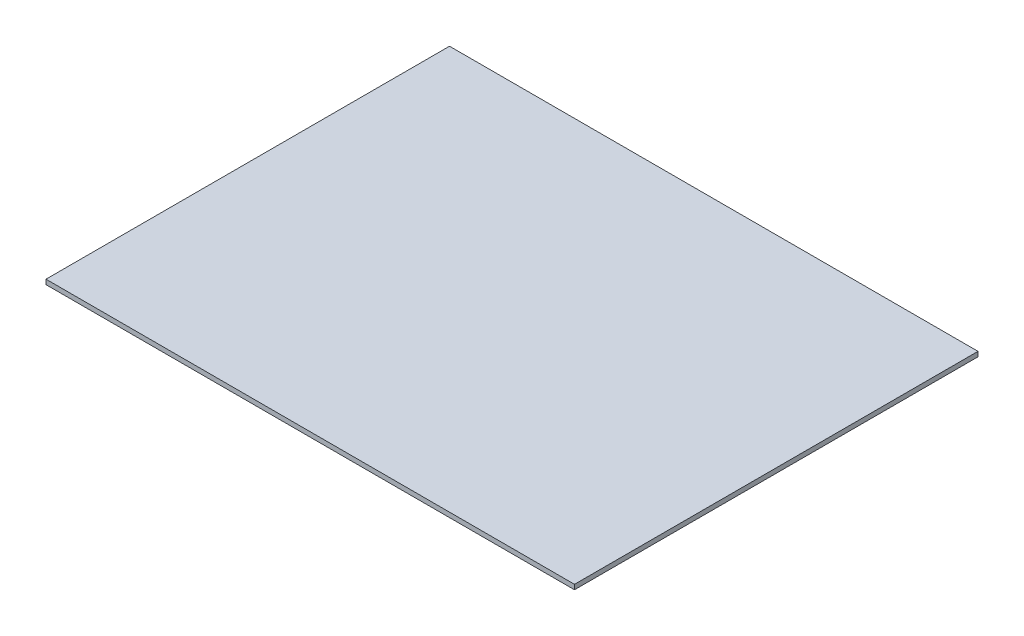
ISO-10303-21;
HEADER;
FILE_DESCRIPTION(('STEP AP214'),'2;1');
FILE_NAME('part.step','',(''),(''),'','','');
FILE_SCHEMA(('AUTOMOTIVE_DESIGN { 1 0 10303 214 1 1 1 1 }'));
ENDSEC;
DATA;
#1=APPLICATION_CONTEXT('core data for automotive mechanical design processes');
#2=APPLICATION_PROTOCOL_DEFINITION('international standard','automotive_design',2000,#1);
#3=PRODUCT_CONTEXT('',#1,'mechanical');
#4=PRODUCT('Part','Part','',(#3));
#5=PRODUCT_RELATED_PRODUCT_CATEGORY('part','',(#4));
#6=PRODUCT_DEFINITION_FORMATION('','',#4);
#7=PRODUCT_DEFINITION_CONTEXT('part definition',#1,'design');
#8=PRODUCT_DEFINITION('design','',#6,#7);
#9=PRODUCT_DEFINITION_SHAPE('','',#8);
#10=(LENGTH_UNIT() NAMED_UNIT(*) SI_UNIT(.MILLI.,.METRE.));
#11=(NAMED_UNIT(*) PLANE_ANGLE_UNIT() SI_UNIT($,.RADIAN.));
#12=(NAMED_UNIT(*) SI_UNIT($,.STERADIAN.) SOLID_ANGLE_UNIT());
#13=UNCERTAINTY_MEASURE_WITH_UNIT(LENGTH_MEASURE(1.E-05),#10,'distance_accuracy_value','');
#14=(GEOMETRIC_REPRESENTATION_CONTEXT(3) GLOBAL_UNCERTAINTY_ASSIGNED_CONTEXT((#13)) GLOBAL_UNIT_ASSIGNED_CONTEXT((#10,
#11,#12)) REPRESENTATION_CONTEXT('',''));
#15=CARTESIAN_POINT('',(0.,0.,0.));
#16=DIRECTION('',(0.,0.,1.));
#17=DIRECTION('',(1.,0.,0.));
#18=AXIS2_PLACEMENT_3D('',#15,#16,#17);
#19=CARTESIAN_POINT('',(222.,4.,169.5));
#20=DIRECTION('',(-1.,0.,0.));
#21=DIRECTION('',(0.,0.,1.));
#22=AXIS2_PLACEMENT_3D('',#19,#20,#21);
#23=PLANE('',#22);
#24=DIRECTION('',(0.,0.,-1.));
#25=VECTOR('',#24,1.);
#26=CARTESIAN_POINT('',(222.,0.,169.5));
#27=LINE('',#26,#25);
#28=CARTESIAN_POINT('',(222.,0.,169.5));
#29=VERTEX_POINT('',#28);
#30=CARTESIAN_POINT('',(222.,0.,-169.5));
#31=VERTEX_POINT('',#30);
#32=EDGE_CURVE('E98',#29,#31,#27,.T.);
#33=ORIENTED_EDGE('',*,*,#32,.T.);
#34=DIRECTION('',(0.,-1.,0.));
#35=VECTOR('',#34,1.);
#36=CARTESIAN_POINT('',(222.,4.,-169.5));
#37=LINE('',#36,#35);
#38=CARTESIAN_POINT('',(222.,4.,-169.5));
#39=VERTEX_POINT('',#38);
#40=EDGE_CURVE('E11',#39,#31,#37,.T.);
#41=ORIENTED_EDGE('',*,*,#40,.F.);
#42=DIRECTION('',(0.,0.,-1.));
#43=VECTOR('',#42,1.);
#44=CARTESIAN_POINT('',(222.,4.,169.5));
#45=LINE('',#44,#43);
#46=CARTESIAN_POINT('',(222.,4.,169.5));
#47=VERTEX_POINT('',#46);
#48=EDGE_CURVE('E86',#47,#39,#45,.T.);
#49=ORIENTED_EDGE('',*,*,#48,.F.);
#50=DIRECTION('',(0.,-1.,0.));
#51=VECTOR('',#50,1.);
#52=CARTESIAN_POINT('',(222.,4.,169.5));
#53=LINE('',#52,#51);
#54=EDGE_CURVE('E94',#47,#29,#53,.T.);
#55=ORIENTED_EDGE('',*,*,#54,.T.);
#56=EDGE_LOOP('',(#33,#41,#49,#55));
#57=FACE_BOUND('',#56,.T.);
#58=ADVANCED_FACE('F35',(#57),#23,.F.);
#59=CARTESIAN_POINT('',(-222.,4.,-169.5));
#60=DIRECTION('',(0.,0.,1.));
#61=DIRECTION('',(1.,0.,0.));
#62=AXIS2_PLACEMENT_3D('',#59,#60,#61);
#63=PLANE('',#62);
#64=DIRECTION('',(-1.,0.,0.));
#65=VECTOR('',#64,1.);
#66=CARTESIAN_POINT('',(-222.,0.,-169.5));
#67=LINE('',#66,#65);
#68=CARTESIAN_POINT('',(-222.,0.,-169.5));
#69=VERTEX_POINT('',#68);
#70=EDGE_CURVE('E90',#31,#69,#67,.T.);
#71=ORIENTED_EDGE('',*,*,#70,.T.);
#72=DIRECTION('',(0.,-1.,0.));
#73=VECTOR('',#72,1.);
#74=CARTESIAN_POINT('',(-222.,4.,-169.5));
#75=LINE('',#74,#73);
#76=CARTESIAN_POINT('',(-222.,4.,-169.5));
#77=VERTEX_POINT('',#76);
#78=EDGE_CURVE('E43',#77,#69,#75,.T.);
#79=ORIENTED_EDGE('',*,*,#78,.F.);
#80=DIRECTION('',(-1.,0.,0.));
#81=VECTOR('',#80,1.);
#82=CARTESIAN_POINT('',(-222.,4.,-169.5));
#83=LINE('',#82,#81);
#84=EDGE_CURVE('E81',#39,#77,#83,.T.);
#85=ORIENTED_EDGE('',*,*,#84,.F.);
#86=ORIENTED_EDGE('',*,*,#40,.T.);
#87=EDGE_LOOP('',(#71,#79,#85,#86));
#88=FACE_BOUND('',#87,.T.);
#89=ADVANCED_FACE('F89',(#88),#63,.F.);
#90=CARTESIAN_POINT('',(-222.,4.,169.5));
#91=DIRECTION('',(1.,0.,0.));
#92=DIRECTION('',(0.,0.,-1.));
#93=AXIS2_PLACEMENT_3D('',#90,#91,#92);
#94=PLANE('',#93);
#95=DIRECTION('',(0.,0.,1.));
#96=VECTOR('',#95,1.);
#97=CARTESIAN_POINT('',(-222.,0.,169.5));
#98=LINE('',#97,#96);
#99=CARTESIAN_POINT('',(-222.,0.,169.5));
#100=VERTEX_POINT('',#99);
#101=EDGE_CURVE('E68',#69,#100,#98,.T.);
#102=ORIENTED_EDGE('',*,*,#101,.T.);
#103=DIRECTION('',(0.,-1.,0.));
#104=VECTOR('',#103,1.);
#105=CARTESIAN_POINT('',(-222.,4.,169.5));
#106=LINE('',#105,#104);
#107=CARTESIAN_POINT('',(-222.,4.,169.5));
#108=VERTEX_POINT('',#107);
#109=EDGE_CURVE('E91',#108,#100,#106,.T.);
#110=ORIENTED_EDGE('',*,*,#109,.F.);
#111=DIRECTION('',(0.,0.,1.));
#112=VECTOR('',#111,1.);
#113=CARTESIAN_POINT('',(-222.,4.,169.5));
#114=LINE('',#113,#112);
#115=EDGE_CURVE('E84',#77,#108,#114,.T.);
#116=ORIENTED_EDGE('',*,*,#115,.F.);
#117=ORIENTED_EDGE('',*,*,#78,.T.);
#118=EDGE_LOOP('',(#102,#110,#116,#117));
#119=FACE_BOUND('',#118,.T.);
#120=ADVANCED_FACE('F92',(#119),#94,.F.);
#121=CARTESIAN_POINT('',(-222.,4.,169.5));
#122=DIRECTION('',(0.,0.,-1.));
#123=DIRECTION('',(-1.,0.,0.));
#124=AXIS2_PLACEMENT_3D('',#121,#122,#123);
#125=PLANE('',#124);
#126=DIRECTION('',(1.,0.,0.));
#127=VECTOR('',#126,1.);
#128=CARTESIAN_POINT('',(-222.,0.,169.5));
#129=LINE('',#128,#127);
#130=EDGE_CURVE('E74',#100,#29,#129,.T.);
#131=ORIENTED_EDGE('',*,*,#130,.T.);
#132=ORIENTED_EDGE('',*,*,#54,.F.);
#133=DIRECTION('',(1.,0.,0.));
#134=VECTOR('',#133,1.);
#135=CARTESIAN_POINT('',(-222.,4.,169.5));
#136=LINE('',#135,#134);
#137=EDGE_CURVE('E51',#108,#47,#136,.T.);
#138=ORIENTED_EDGE('',*,*,#137,.F.);
#139=ORIENTED_EDGE('',*,*,#109,.T.);
#140=EDGE_LOOP('',(#131,#132,#138,#139));
#141=FACE_BOUND('',#140,.T.);
#142=ADVANCED_FACE('F105',(#141),#125,.F.);
#143=CARTESIAN_POINT('',(0.,4.,0.));
#144=DIRECTION('',(0.,-1.,0.));
#145=DIRECTION('',(0.,0.,-1.));
#146=AXIS2_PLACEMENT_3D('',#143,#144,#145);
#147=PLANE('',#146);
#148=ORIENTED_EDGE('',*,*,#48,.T.);
#149=ORIENTED_EDGE('',*,*,#84,.T.);
#150=ORIENTED_EDGE('',*,*,#115,.T.);
#151=ORIENTED_EDGE('',*,*,#137,.T.);
#152=EDGE_LOOP('',(#148,#149,#150,#151));
#153=FACE_BOUND('',#152,.T.);
#154=ADVANCED_FACE('F82',(#153),#147,.F.);
#155=CARTESIAN_POINT('',(0.,0.,0.));
#156=DIRECTION('',(0.,-1.,0.));
#157=DIRECTION('',(0.,0.,-1.));
#158=AXIS2_PLACEMENT_3D('',#155,#156,#157);
#159=PLANE('',#158);
#160=ORIENTED_EDGE('',*,*,#32,.F.);
#161=ORIENTED_EDGE('',*,*,#130,.F.);
#162=ORIENTED_EDGE('',*,*,#101,.F.);
#163=ORIENTED_EDGE('',*,*,#70,.F.);
#164=EDGE_LOOP('',(#160,#161,#162,#163));
#165=FACE_BOUND('',#164,.T.);
#166=ADVANCED_FACE('F108',(#165),#159,.T.);
#167=CLOSED_SHELL('',(#58,#89,#120,#142,#154,#166));
#168=MANIFOLD_SOLID_BREP('B2',#167);
#169=ADVANCED_BREP_SHAPE_REPRESENTATION('',(#18,#168),#14);
#170=SHAPE_DEFINITION_REPRESENTATION(#9,#169);
ENDSEC;
END-ISO-10303-21;
